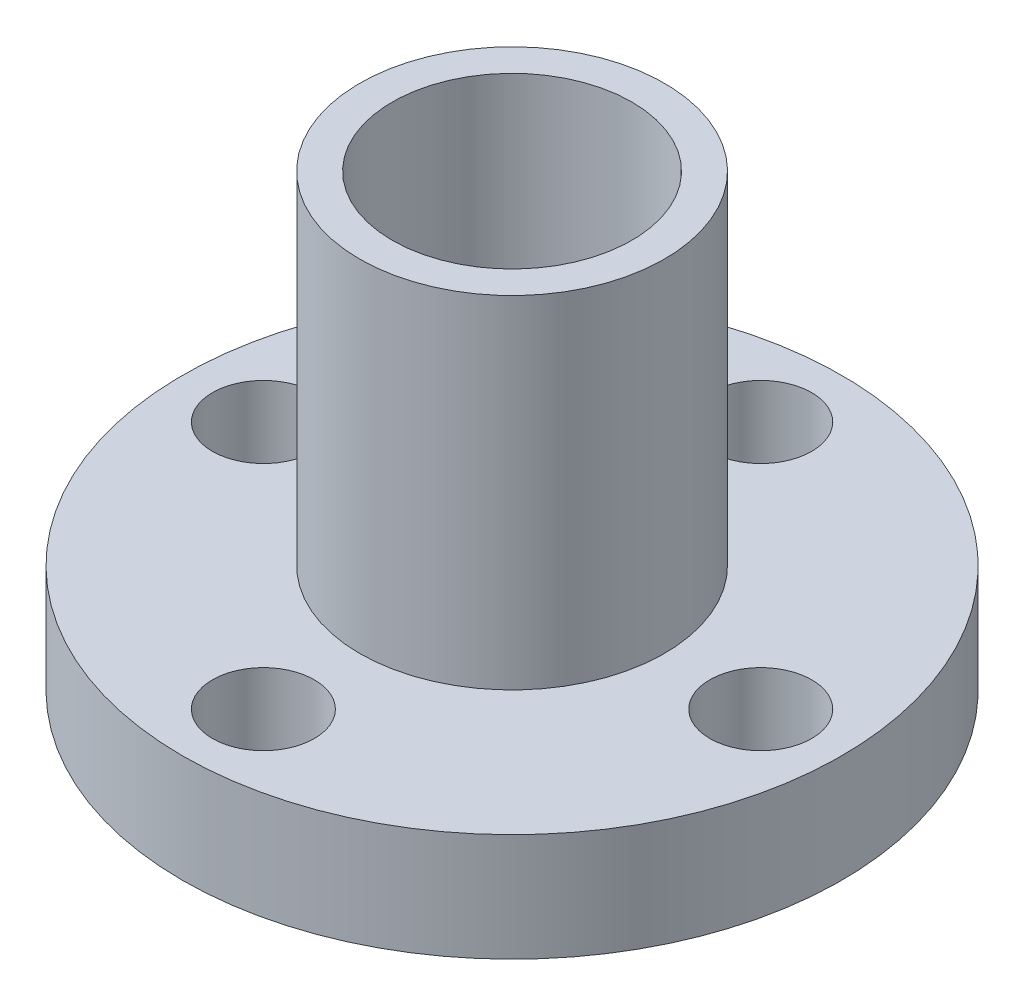
ISO-10303-21;
HEADER;
FILE_DESCRIPTION(('STEP AP214'),'2;1');
FILE_NAME('part.step','',(''),(''),'','','');
FILE_SCHEMA(('AUTOMOTIVE_DESIGN { 1 0 10303 214 1 1 1 1 }'));
ENDSEC;
DATA;
#1=APPLICATION_CONTEXT('core data for automotive mechanical design processes');
#2=APPLICATION_PROTOCOL_DEFINITION('international standard','automotive_design',2000,#1);
#3=PRODUCT_CONTEXT('',#1,'mechanical');
#4=PRODUCT('Part','Part','',(#3));
#5=PRODUCT_RELATED_PRODUCT_CATEGORY('part','',(#4));
#6=PRODUCT_DEFINITION_FORMATION('','',#4);
#7=PRODUCT_DEFINITION_CONTEXT('part definition',#1,'design');
#8=PRODUCT_DEFINITION('design','',#6,#7);
#9=PRODUCT_DEFINITION_SHAPE('','',#8);
#10=(LENGTH_UNIT() NAMED_UNIT(*) SI_UNIT(.MILLI.,.METRE.));
#11=(NAMED_UNIT(*) PLANE_ANGLE_UNIT() SI_UNIT($,.RADIAN.));
#12=(NAMED_UNIT(*) SI_UNIT($,.STERADIAN.) SOLID_ANGLE_UNIT());
#13=UNCERTAINTY_MEASURE_WITH_UNIT(LENGTH_MEASURE(1.E-05),#10,'distance_accuracy_value','');
#14=(GEOMETRIC_REPRESENTATION_CONTEXT(3) GLOBAL_UNCERTAINTY_ASSIGNED_CONTEXT((#13)) GLOBAL_UNIT_ASSIGNED_CONTEXT((#10,
#11,#12)) REPRESENTATION_CONTEXT('',''));
#15=CARTESIAN_POINT('',(0.,0.,0.));
#16=DIRECTION('',(0.,0.,1.));
#17=DIRECTION('',(1.,0.,0.));
#18=AXIS2_PLACEMENT_3D('',#15,#16,#17);
#19=CARTESIAN_POINT('',(0.,3.6,0.));
#20=DIRECTION('',(0.,1.,0.));
#21=DIRECTION('',(0.,0.,1.));
#22=AXIS2_PLACEMENT_3D('',#19,#20,#21);
#23=PLANE('',#22);
#24=CARTESIAN_POINT('',(0.,3.6,0.));
#25=DIRECTION('',(0.,1.,0.));
#26=DIRECTION('',(0.,0.,1.));
#27=AXIS2_PLACEMENT_3D('',#24,#25,#26);
#28=CIRCLE('',#27,5.085);
#29=CARTESIAN_POINT('',(0.,3.6,5.085));
#30=VERTEX_POINT('',#29);
#31=EDGE_CURVE('E65',#30,#30,#28,.F.);
#32=ORIENTED_EDGE('',*,*,#31,.T.);
#33=EDGE_LOOP('',(#32));
#34=FACE_BOUND('',#33,.T.);
#35=CARTESIAN_POINT('',(8.3,3.6,0.));
#36=DIRECTION('',(0.,1.,0.));
#37=DIRECTION('',(0.,0.,1.));
#38=AXIS2_PLACEMENT_3D('',#35,#36,#37);
#39=CIRCLE('',#38,1.7);
#40=CARTESIAN_POINT('',(8.3,3.6,1.70000000000006));
#41=VERTEX_POINT('',#40);
#42=EDGE_CURVE('E53',#41,#41,#39,.T.);
#43=ORIENTED_EDGE('',*,*,#42,.F.);
#44=EDGE_LOOP('',(#43));
#45=FACE_BOUND('',#44,.T.);
#46=CARTESIAN_POINT('',(-8.3,3.6,0.));
#47=DIRECTION('',(0.,1.,0.));
#48=DIRECTION('',(0.,0.,1.));
#49=AXIS2_PLACEMENT_3D('',#46,#47,#48);
#50=CIRCLE('',#49,1.7);
#51=CARTESIAN_POINT('',(-8.3,3.6,1.7));
#52=VERTEX_POINT('',#51);
#53=EDGE_CURVE('E42',#52,#52,#50,.T.);
#54=ORIENTED_EDGE('',*,*,#53,.F.);
#55=EDGE_LOOP('',(#54));
#56=FACE_BOUND('',#55,.T.);
#57=CARTESIAN_POINT('',(0.,3.6,0.));
#58=DIRECTION('',(0.,1.,0.));
#59=DIRECTION('',(0.,0.,1.));
#60=AXIS2_PLACEMENT_3D('',#57,#58,#59);
#61=CIRCLE('',#60,11.);
#62=CARTESIAN_POINT('',(0.,3.6,11.));
#63=VERTEX_POINT('',#62);
#64=EDGE_CURVE('E10',#63,#63,#61,.T.);
#65=ORIENTED_EDGE('',*,*,#64,.T.);
#66=EDGE_LOOP('',(#65));
#67=FACE_BOUND('',#66,.T.);
#68=CARTESIAN_POINT('',(0.,3.6,-8.3));
#69=DIRECTION('',(0.,1.,0.));
#70=DIRECTION('',(0.,0.,1.));
#71=AXIS2_PLACEMENT_3D('',#68,#69,#70);
#72=CIRCLE('',#71,1.7);
#73=CARTESIAN_POINT('',(0.,3.6,-6.6));
#74=VERTEX_POINT('',#73);
#75=EDGE_CURVE('E47',#74,#74,#72,.T.);
#76=ORIENTED_EDGE('',*,*,#75,.F.);
#77=EDGE_LOOP('',(#76));
#78=FACE_BOUND('',#77,.T.);
#79=CARTESIAN_POINT('',(0.,3.6,8.3));
#80=DIRECTION('',(0.,1.,0.));
#81=DIRECTION('',(0.,0.,1.));
#82=AXIS2_PLACEMENT_3D('',#79,#80,#81);
#83=CIRCLE('',#82,1.7);
#84=CARTESIAN_POINT('',(0.,3.6,10.));
#85=VERTEX_POINT('',#84);
#86=EDGE_CURVE('E59',#85,#85,#83,.T.);
#87=ORIENTED_EDGE('',*,*,#86,.F.);
#88=EDGE_LOOP('',(#87));
#89=FACE_BOUND('',#88,.T.);
#90=ADVANCED_FACE('F31',(#34,#45,#56,#67,#78,#89),#23,.T.);
#91=CARTESIAN_POINT('',(0.,0.,0.));
#92=DIRECTION('',(0.,1.,0.));
#93=DIRECTION('',(0.,0.,1.));
#94=AXIS2_PLACEMENT_3D('',#91,#92,#93);
#95=PLANE('',#94);
#96=CARTESIAN_POINT('',(0.,0.,0.));
#97=DIRECTION('',(0.,1.,0.));
#98=DIRECTION('',(0.,0.,1.));
#99=AXIS2_PLACEMENT_3D('',#96,#97,#98);
#100=CIRCLE('',#99,11.);
#101=CARTESIAN_POINT('',(0.,0.,11.));
#102=VERTEX_POINT('',#101);
#103=EDGE_CURVE('E35',#102,#102,#100,.T.);
#104=ORIENTED_EDGE('',*,*,#103,.F.);
#105=EDGE_LOOP('',(#104));
#106=FACE_BOUND('',#105,.T.);
#107=CARTESIAN_POINT('',(-8.3,0.,0.));
#108=DIRECTION('',(0.,1.,0.));
#109=DIRECTION('',(0.,0.,1.));
#110=AXIS2_PLACEMENT_3D('',#107,#108,#109);
#111=CIRCLE('',#110,1.7);
#112=CARTESIAN_POINT('',(-8.3,0.,1.7));
#113=VERTEX_POINT('',#112);
#114=EDGE_CURVE('E44',#113,#113,#111,.T.);
#115=ORIENTED_EDGE('',*,*,#114,.T.);
#116=EDGE_LOOP('',(#115));
#117=FACE_BOUND('',#116,.T.);
#118=CARTESIAN_POINT('',(0.,0.,-8.3));
#119=DIRECTION('',(0.,1.,0.));
#120=DIRECTION('',(0.,0.,1.));
#121=AXIS2_PLACEMENT_3D('',#118,#119,#120);
#122=CIRCLE('',#121,1.7);
#123=CARTESIAN_POINT('',(0.,0.,-6.6));
#124=VERTEX_POINT('',#123);
#125=EDGE_CURVE('E50',#124,#124,#122,.T.);
#126=ORIENTED_EDGE('',*,*,#125,.T.);
#127=EDGE_LOOP('',(#126));
#128=FACE_BOUND('',#127,.T.);
#129=CARTESIAN_POINT('',(8.3,0.,0.));
#130=DIRECTION('',(0.,1.,0.));
#131=DIRECTION('',(0.,0.,1.));
#132=AXIS2_PLACEMENT_3D('',#129,#130,#131);
#133=CIRCLE('',#132,1.7);
#134=CARTESIAN_POINT('',(8.3,0.,1.70000000000006));
#135=VERTEX_POINT('',#134);
#136=EDGE_CURVE('E56',#135,#135,#133,.T.);
#137=ORIENTED_EDGE('',*,*,#136,.T.);
#138=EDGE_LOOP('',(#137));
#139=FACE_BOUND('',#138,.T.);
#140=CARTESIAN_POINT('',(0.,0.,8.3));
#141=DIRECTION('',(0.,1.,0.));
#142=DIRECTION('',(0.,0.,1.));
#143=AXIS2_PLACEMENT_3D('',#140,#141,#142);
#144=CIRCLE('',#143,1.7);
#145=CARTESIAN_POINT('',(0.,0.,10.));
#146=VERTEX_POINT('',#145);
#147=EDGE_CURVE('E62',#146,#146,#144,.T.);
#148=ORIENTED_EDGE('',*,*,#147,.T.);
#149=EDGE_LOOP('',(#148));
#150=FACE_BOUND('',#149,.T.);
#151=CARTESIAN_POINT('',(0.,0.,0.));
#152=DIRECTION('',(0.,1.,0.));
#153=DIRECTION('',(0.,0.,1.));
#154=AXIS2_PLACEMENT_3D('',#151,#152,#153);
#155=CIRCLE('',#154,4.);
#156=CARTESIAN_POINT('',(0.,0.,4.));
#157=VERTEX_POINT('',#156);
#158=EDGE_CURVE('E74',#157,#157,#155,.T.);
#159=ORIENTED_EDGE('',*,*,#158,.T.);
#160=EDGE_LOOP('',(#159));
#161=FACE_BOUND('',#160,.T.);
#162=ADVANCED_FACE('F100',(#106,#117,#128,#139,#150,#161),#95,.F.);
#163=CARTESIAN_POINT('',(0.,3.6,0.));
#164=DIRECTION('',(0.,-1.,0.));
#165=DIRECTION('',(0.,0.,-1.));
#166=AXIS2_PLACEMENT_3D('',#163,#164,#165);
#167=CYLINDRICAL_SURFACE('',#166,11.);
#168=ORIENTED_EDGE('',*,*,#64,.F.);
#169=EDGE_LOOP('',(#168));
#170=FACE_BOUND('',#169,.T.);
#171=ORIENTED_EDGE('',*,*,#103,.T.);
#172=EDGE_LOOP('',(#171));
#173=FACE_BOUND('',#172,.T.);
#174=ADVANCED_FACE('F33',(#170,#173),#167,.T.);
#175=CARTESIAN_POINT('',(-8.3,3.6,0.));
#176=DIRECTION('',(0.,-1.,0.));
#177=DIRECTION('',(0.,0.,-1.));
#178=AXIS2_PLACEMENT_3D('',#175,#176,#177);
#179=CYLINDRICAL_SURFACE('',#178,1.7);
#180=ORIENTED_EDGE('',*,*,#53,.T.);
#181=EDGE_LOOP('',(#180));
#182=FACE_BOUND('',#181,.T.);
#183=ORIENTED_EDGE('',*,*,#114,.F.);
#184=EDGE_LOOP('',(#183));
#185=FACE_BOUND('',#184,.T.);
#186=ADVANCED_FACE('F109',(#182,#185),#179,.F.);
#187=CARTESIAN_POINT('',(0.,3.6,-8.3));
#188=DIRECTION('',(0.,-1.,0.));
#189=DIRECTION('',(0.,0.,-1.));
#190=AXIS2_PLACEMENT_3D('',#187,#188,#189);
#191=CYLINDRICAL_SURFACE('',#190,1.7);
#192=ORIENTED_EDGE('',*,*,#75,.T.);
#193=EDGE_LOOP('',(#192));
#194=FACE_BOUND('',#193,.T.);
#195=ORIENTED_EDGE('',*,*,#125,.F.);
#196=EDGE_LOOP('',(#195));
#197=FACE_BOUND('',#196,.T.);
#198=ADVANCED_FACE('F112',(#194,#197),#191,.F.);
#199=CARTESIAN_POINT('',(8.3,3.6,0.));
#200=DIRECTION('',(0.,-1.,0.));
#201=DIRECTION('',(0.,0.,-1.));
#202=AXIS2_PLACEMENT_3D('',#199,#200,#201);
#203=CYLINDRICAL_SURFACE('',#202,1.7);
#204=ORIENTED_EDGE('',*,*,#42,.T.);
#205=EDGE_LOOP('',(#204));
#206=FACE_BOUND('',#205,.T.);
#207=ORIENTED_EDGE('',*,*,#136,.F.);
#208=EDGE_LOOP('',(#207));
#209=FACE_BOUND('',#208,.T.);
#210=ADVANCED_FACE('F95',(#206,#209),#203,.F.);
#211=CARTESIAN_POINT('',(0.,3.6,8.3));
#212=DIRECTION('',(0.,-1.,0.));
#213=DIRECTION('',(0.,0.,-1.));
#214=AXIS2_PLACEMENT_3D('',#211,#212,#213);
#215=CYLINDRICAL_SURFACE('',#214,1.7);
#216=ORIENTED_EDGE('',*,*,#86,.T.);
#217=EDGE_LOOP('',(#216));
#218=FACE_BOUND('',#217,.T.);
#219=ORIENTED_EDGE('',*,*,#147,.F.);
#220=EDGE_LOOP('',(#219));
#221=FACE_BOUND('',#220,.T.);
#222=ADVANCED_FACE('F86',(#218,#221),#215,.F.);
#223=CARTESIAN_POINT('',(0.,15.,0.));
#224=DIRECTION('',(0.,1.,0.));
#225=DIRECTION('',(0.,0.,1.));
#226=AXIS2_PLACEMENT_3D('',#223,#224,#225);
#227=PLANE('',#226);
#228=CARTESIAN_POINT('',(0.,15.,0.));
#229=DIRECTION('',(0.,1.,0.));
#230=DIRECTION('',(0.,0.,1.));
#231=AXIS2_PLACEMENT_3D('',#228,#229,#230);
#232=CIRCLE('',#231,5.085);
#233=CARTESIAN_POINT('',(0.,15.,5.085));
#234=VERTEX_POINT('',#233);
#235=EDGE_CURVE('E70',#234,#234,#232,.T.);
#236=ORIENTED_EDGE('',*,*,#235,.T.);
#237=EDGE_LOOP('',(#236));
#238=FACE_BOUND('',#237,.T.);
#239=CARTESIAN_POINT('',(0.,15.,0.));
#240=DIRECTION('',(0.,1.,0.));
#241=DIRECTION('',(0.,0.,1.));
#242=AXIS2_PLACEMENT_3D('',#239,#240,#241);
#243=CIRCLE('',#242,4.);
#244=CARTESIAN_POINT('',(0.,15.,4.));
#245=VERTEX_POINT('',#244);
#246=EDGE_CURVE('E73',#245,#245,#243,.T.);
#247=ORIENTED_EDGE('',*,*,#246,.F.);
#248=EDGE_LOOP('',(#247));
#249=FACE_BOUND('',#248,.T.);
#250=ADVANCED_FACE('F83',(#238,#249),#227,.T.);
#251=CARTESIAN_POINT('',(0.,15.,0.));
#252=DIRECTION('',(0.,-1.,0.));
#253=DIRECTION('',(0.,0.,-1.));
#254=AXIS2_PLACEMENT_3D('',#251,#252,#253);
#255=CYLINDRICAL_SURFACE('',#254,5.085);
#256=ORIENTED_EDGE('',*,*,#31,.F.);
#257=EDGE_LOOP('',(#256));
#258=FACE_BOUND('',#257,.T.);
#259=ORIENTED_EDGE('',*,*,#235,.F.);
#260=EDGE_LOOP('',(#259));
#261=FACE_BOUND('',#260,.T.);
#262=ADVANCED_FACE('F85',(#258,#261),#255,.T.);
#263=CARTESIAN_POINT('',(0.,15.,0.));
#264=DIRECTION('',(0.,-1.,0.));
#265=DIRECTION('',(0.,0.,-1.));
#266=AXIS2_PLACEMENT_3D('',#263,#264,#265);
#267=CYLINDRICAL_SURFACE('',#266,4.);
#268=ORIENTED_EDGE('',*,*,#246,.T.);
#269=EDGE_LOOP('',(#268));
#270=FACE_BOUND('',#269,.T.);
#271=ORIENTED_EDGE('',*,*,#158,.F.);
#272=EDGE_LOOP('',(#271));
#273=FACE_BOUND('',#272,.T.);
#274=ADVANCED_FACE('F80',(#270,#273),#267,.F.);
#275=CLOSED_SHELL('',(#90,#162,#174,#186,#198,#210,#222,#250,#262,#274));
#276=MANIFOLD_SOLID_BREP('B2',#275);
#277=ADVANCED_BREP_SHAPE_REPRESENTATION('',(#18,#276),#14);
#278=SHAPE_DEFINITION_REPRESENTATION(#9,#277);
ENDSEC;
END-ISO-10303-21;
